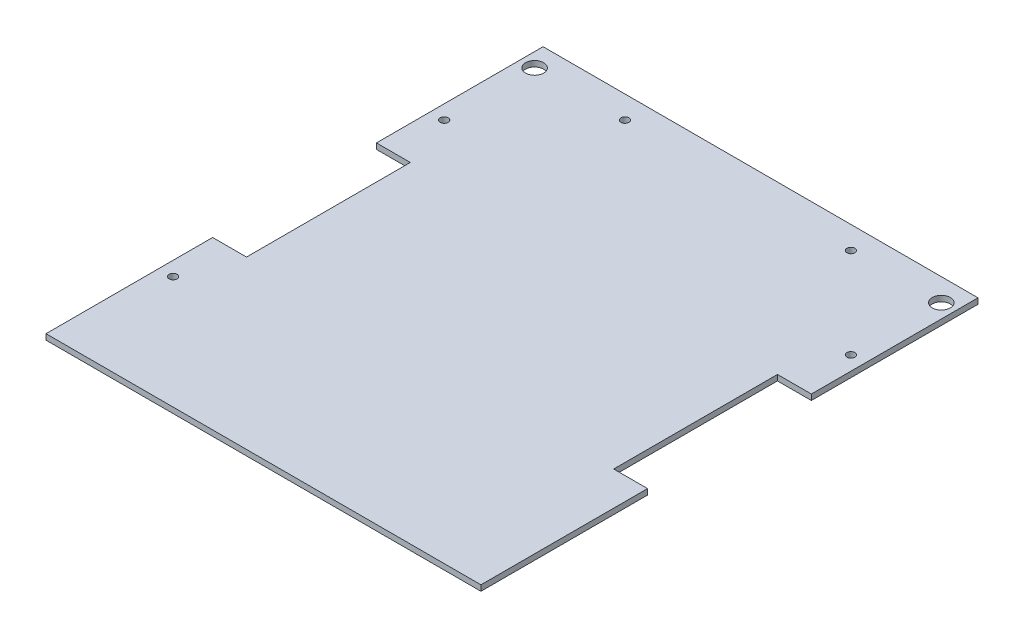
ISO-10303-21;
HEADER;
FILE_DESCRIPTION(('STEP AP214'),'2;1');
FILE_NAME('part.step','',(''),(''),'','','');
FILE_SCHEMA(('AUTOMOTIVE_DESIGN { 1 0 10303 214 1 1 1 1 }'));
ENDSEC;
DATA;
#1=APPLICATION_CONTEXT('core data for automotive mechanical design processes');
#2=APPLICATION_PROTOCOL_DEFINITION('international standard','automotive_design',2000,#1);
#3=PRODUCT_CONTEXT('',#1,'mechanical');
#4=PRODUCT('Part','Part','',(#3));
#5=PRODUCT_RELATED_PRODUCT_CATEGORY('part','',(#4));
#6=PRODUCT_DEFINITION_FORMATION('','',#4);
#7=PRODUCT_DEFINITION_CONTEXT('part definition',#1,'design');
#8=PRODUCT_DEFINITION('design','',#6,#7);
#9=PRODUCT_DEFINITION_SHAPE('','',#8);
#10=(LENGTH_UNIT() NAMED_UNIT(*) SI_UNIT(.MILLI.,.METRE.));
#11=(NAMED_UNIT(*) PLANE_ANGLE_UNIT() SI_UNIT($,.RADIAN.));
#12=(NAMED_UNIT(*) SI_UNIT($,.STERADIAN.) SOLID_ANGLE_UNIT());
#13=UNCERTAINTY_MEASURE_WITH_UNIT(LENGTH_MEASURE(1.E-05),#10,'distance_accuracy_value','');
#14=(GEOMETRIC_REPRESENTATION_CONTEXT(3) GLOBAL_UNCERTAINTY_ASSIGNED_CONTEXT((#13)) GLOBAL_UNIT_ASSIGNED_CONTEXT((#10,
#11,#12)) REPRESENTATION_CONTEXT('',''));
#15=CARTESIAN_POINT('',(0.,0.,0.));
#16=DIRECTION('',(0.,0.,1.));
#17=DIRECTION('',(1.,0.,0.));
#18=AXIS2_PLACEMENT_3D('',#15,#16,#17);
#19=CARTESIAN_POINT('',(228.6,3.175,139.7));
#20=DIRECTION('',(0.,0.,-1.));
#21=DIRECTION('',(-1.,0.,0.));
#22=AXIS2_PLACEMENT_3D('',#19,#20,#21);
#23=PLANE('',#22);
#24=DIRECTION('',(0.,1.,0.));
#25=VECTOR('',#24,1.);
#26=CARTESIAN_POINT('',(122.2375,-22.225,139.7));
#27=LINE('',#26,#25);
#28=CARTESIAN_POINT('',(122.2375,0.,139.7));
#29=VERTEX_POINT('',#28);
#30=CARTESIAN_POINT('',(122.2375,3.175,139.7));
#31=VERTEX_POINT('',#30);
#32=EDGE_CURVE('E231',#29,#31,#27,.T.);
#33=ORIENTED_EDGE('',*,*,#32,.T.);
#34=DIRECTION('',(1.,0.,0.));
#35=VECTOR('',#34,1.);
#36=CARTESIAN_POINT('',(228.6,3.175,139.7));
#37=LINE('',#36,#35);
#38=CARTESIAN_POINT('',(-122.2375,3.175,139.7));
#39=VERTEX_POINT('',#38);
#40=EDGE_CURVE('E181',#39,#31,#37,.T.);
#41=ORIENTED_EDGE('',*,*,#40,.F.);
#42=DIRECTION('',(0.,1.,0.));
#43=VECTOR('',#42,1.);
#44=CARTESIAN_POINT('',(-122.2375,-22.225,139.7));
#45=LINE('',#44,#43);
#46=CARTESIAN_POINT('',(-122.2375,0.,139.7));
#47=VERTEX_POINT('',#46);
#48=EDGE_CURVE('E150',#47,#39,#45,.T.);
#49=ORIENTED_EDGE('',*,*,#48,.F.);
#50=DIRECTION('',(1.,0.,0.));
#51=VECTOR('',#50,1.);
#52=CARTESIAN_POINT('',(228.6,0.,139.7));
#53=LINE('',#52,#51);
#54=EDGE_CURVE('E184',#47,#29,#53,.T.);
#55=ORIENTED_EDGE('',*,*,#54,.T.);
#56=EDGE_LOOP('',(#33,#41,#49,#55));
#57=FACE_BOUND('',#56,.T.);
#58=ADVANCED_FACE('F44',(#57),#23,.F.);
#59=CARTESIAN_POINT('',(228.6,3.175,-139.7));
#60=DIRECTION('',(0.,0.,1.));
#61=DIRECTION('',(1.,0.,0.));
#62=AXIS2_PLACEMENT_3D('',#59,#60,#61);
#63=PLANE('',#62);
#64=DIRECTION('',(0.,1.,0.));
#65=VECTOR('',#64,1.);
#66=CARTESIAN_POINT('',(122.2375,-22.225,-139.7));
#67=LINE('',#66,#65);
#68=CARTESIAN_POINT('',(122.2375,0.,-139.7));
#69=VERTEX_POINT('',#68);
#70=CARTESIAN_POINT('',(122.2375,3.175,-139.7));
#71=VERTEX_POINT('',#70);
#72=EDGE_CURVE('E145',#69,#71,#67,.T.);
#73=ORIENTED_EDGE('',*,*,#72,.F.);
#74=DIRECTION('',(-1.,0.,0.));
#75=VECTOR('',#74,1.);
#76=CARTESIAN_POINT('',(228.6,0.,-139.7));
#77=LINE('',#76,#75);
#78=CARTESIAN_POINT('',(-122.2375,0.,-139.7));
#79=VERTEX_POINT('',#78);
#80=EDGE_CURVE('E187',#69,#79,#77,.T.);
#81=ORIENTED_EDGE('',*,*,#80,.T.);
#82=DIRECTION('',(0.,1.,0.));
#83=VECTOR('',#82,1.);
#84=CARTESIAN_POINT('',(-122.2375,-22.225,-139.7));
#85=LINE('',#84,#83);
#86=CARTESIAN_POINT('',(-122.2375,3.175,-139.7));
#87=VERTEX_POINT('',#86);
#88=EDGE_CURVE('E291',#79,#87,#85,.T.);
#89=ORIENTED_EDGE('',*,*,#88,.T.);
#90=DIRECTION('',(-1.,0.,0.));
#91=VECTOR('',#90,1.);
#92=CARTESIAN_POINT('',(228.6,3.175,-139.7));
#93=LINE('',#92,#91);
#94=EDGE_CURVE('E175',#71,#87,#93,.T.);
#95=ORIENTED_EDGE('',*,*,#94,.F.);
#96=EDGE_LOOP('',(#73,#81,#89,#95));
#97=FACE_BOUND('',#96,.T.);
#98=ADVANCED_FACE('F354',(#97),#63,.F.);
#99=CARTESIAN_POINT('',(0.,3.175,0.));
#100=DIRECTION('',(0.,1.,0.));
#101=DIRECTION('',(0.,0.,1.));
#102=AXIS2_PLACEMENT_3D('',#99,#100,#101);
#103=PLANE('',#102);
#104=CARTESIAN_POINT('',(114.3,3.175,-127.));
#105=DIRECTION('',(0.,1.,0.));
#106=DIRECTION('',(0.,0.,-1.));
#107=AXIS2_PLACEMENT_3D('',#104,#105,#106);
#108=CIRCLE('',#107,5.08);
#109=CARTESIAN_POINT('',(114.3,3.175,-132.08));
#110=VERTEX_POINT('',#109);
#111=EDGE_CURVE('E207',#110,#110,#108,.T.);
#112=ORIENTED_EDGE('',*,*,#111,.F.);
#113=EDGE_LOOP('',(#112));
#114=FACE_BOUND('',#113,.T.);
#115=CARTESIAN_POINT('',(-114.3,3.175,-127.));
#116=DIRECTION('',(0.,1.,0.));
#117=DIRECTION('',(0.,0.,1.));
#118=AXIS2_PLACEMENT_3D('',#115,#116,#117);
#119=CIRCLE('',#118,5.08);
#120=CARTESIAN_POINT('',(-114.3,3.175,-121.92));
#121=VERTEX_POINT('',#120);
#122=EDGE_CURVE('E321',#121,#121,#119,.T.);
#123=ORIENTED_EDGE('',*,*,#122,.F.);
#124=EDGE_LOOP('',(#123));
#125=FACE_BOUND('',#124,.T.);
#126=CARTESIAN_POINT('',(-114.3,3.175,76.2));
#127=DIRECTION('',(0.,1.,0.));
#128=DIRECTION('',(0.,0.,1.));
#129=AXIS2_PLACEMENT_3D('',#126,#127,#128);
#130=CIRCLE('',#129,2.25);
#131=CARTESIAN_POINT('',(-114.3,3.175,78.45));
#132=VERTEX_POINT('',#131);
#133=EDGE_CURVE('E195',#132,#132,#130,.T.);
#134=ORIENTED_EDGE('',*,*,#133,.F.);
#135=EDGE_LOOP('',(#134));
#136=FACE_BOUND('',#135,.T.);
#137=CARTESIAN_POINT('',(63.4999999999999,3.175,-127.));
#138=DIRECTION('',(0.,1.,0.));
#139=DIRECTION('',(0.,0.,-1.));
#140=AXIS2_PLACEMENT_3D('',#137,#138,#139);
#141=CIRCLE('',#140,2.25);
#142=CARTESIAN_POINT('',(63.4999999999999,3.175,-129.25));
#143=VERTEX_POINT('',#142);
#144=EDGE_CURVE('E304',#143,#143,#141,.T.);
#145=ORIENTED_EDGE('',*,*,#144,.F.);
#146=EDGE_LOOP('',(#145));
#147=FACE_BOUND('',#146,.T.);
#148=CARTESIAN_POINT('',(-114.3,3.175,-76.2));
#149=DIRECTION('',(0.,1.,0.));
#150=DIRECTION('',(0.,0.,1.));
#151=AXIS2_PLACEMENT_3D('',#148,#149,#150);
#152=CIRCLE('',#151,2.25);
#153=CARTESIAN_POINT('',(-114.3,3.175,-73.95));
#154=VERTEX_POINT('',#153);
#155=EDGE_CURVE('E299',#154,#154,#152,.T.);
#156=ORIENTED_EDGE('',*,*,#155,.F.);
#157=EDGE_LOOP('',(#156));
#158=FACE_BOUND('',#157,.T.);
#159=CARTESIAN_POINT('',(-63.5,3.175,-127.));
#160=DIRECTION('',(0.,1.,0.));
#161=DIRECTION('',(0.,0.,1.));
#162=AXIS2_PLACEMENT_3D('',#159,#160,#161);
#163=CIRCLE('',#162,2.25);
#164=CARTESIAN_POINT('',(-63.5,3.175,-124.75));
#165=VERTEX_POINT('',#164);
#166=EDGE_CURVE('E305',#165,#165,#163,.T.);
#167=ORIENTED_EDGE('',*,*,#166,.F.);
#168=EDGE_LOOP('',(#167));
#169=FACE_BOUND('',#168,.T.);
#170=CARTESIAN_POINT('',(114.3,3.175,-76.2));
#171=DIRECTION('',(0.,1.,0.));
#172=DIRECTION('',(0.,0.,-1.));
#173=AXIS2_PLACEMENT_3D('',#170,#171,#172);
#174=CIRCLE('',#173,2.25);
#175=CARTESIAN_POINT('',(114.3,3.175,-78.45));
#176=VERTEX_POINT('',#175);
#177=EDGE_CURVE('E265',#176,#176,#174,.T.);
#178=ORIENTED_EDGE('',*,*,#177,.F.);
#179=EDGE_LOOP('',(#178));
#180=FACE_BOUND('',#179,.T.);
#181=DIRECTION('',(-1.,0.,0.));
#182=VECTOR('',#181,1.);
#183=CARTESIAN_POINT('',(0.,3.175,-46.0375));
#184=LINE('',#183,#182);
#185=CARTESIAN_POINT('',(122.2375,3.175,-46.0375000000001));
#186=VERTEX_POINT('',#185);
#187=CARTESIAN_POINT('',(103.1875,3.175,-46.0375000000001));
#188=VERTEX_POINT('',#187);
#189=EDGE_CURVE('E133',#186,#188,#184,.T.);
#190=ORIENTED_EDGE('',*,*,#189,.F.);
#191=DIRECTION('',(0.,0.,-1.));
#192=VECTOR('',#191,1.);
#193=CARTESIAN_POINT('',(122.2375,3.175,-1.06858966120171E-13));
#194=LINE('',#193,#192);
#195=EDGE_CURVE('E142',#186,#71,#194,.T.);
#196=ORIENTED_EDGE('',*,*,#195,.T.);
#197=ORIENTED_EDGE('',*,*,#94,.T.);
#198=DIRECTION('',(0.,0.,1.));
#199=VECTOR('',#198,1.);
#200=CARTESIAN_POINT('',(-122.2375,3.175,0.));
#201=LINE('',#200,#199);
#202=CARTESIAN_POINT('',(-122.2375,3.175,-46.0375));
#203=VERTEX_POINT('',#202);
#204=EDGE_CURVE('E282',#87,#203,#201,.T.);
#205=ORIENTED_EDGE('',*,*,#204,.T.);
#206=DIRECTION('',(1.,0.,0.));
#207=VECTOR('',#206,1.);
#208=CARTESIAN_POINT('',(0.,3.175,-46.0375));
#209=LINE('',#208,#207);
#210=CARTESIAN_POINT('',(-103.1875,3.175,-46.0375));
#211=VERTEX_POINT('',#210);
#212=EDGE_CURVE('E279',#203,#211,#209,.T.);
#213=ORIENTED_EDGE('',*,*,#212,.T.);
#214=DIRECTION('',(0.,0.,1.));
#215=VECTOR('',#214,1.);
#216=CARTESIAN_POINT('',(-103.1875,3.175,0.));
#217=LINE('',#216,#215);
#218=CARTESIAN_POINT('',(-103.1875,3.175,46.0375));
#219=VERTEX_POINT('',#218);
#220=EDGE_CURVE('E276',#211,#219,#217,.T.);
#221=ORIENTED_EDGE('',*,*,#220,.T.);
#222=DIRECTION('',(-1.,0.,0.));
#223=VECTOR('',#222,1.);
#224=CARTESIAN_POINT('',(0.,3.175,46.0374999999999));
#225=LINE('',#224,#223);
#226=CARTESIAN_POINT('',(-122.2375,3.175,46.0375));
#227=VERTEX_POINT('',#226);
#228=EDGE_CURVE('E252',#219,#227,#225,.T.);
#229=ORIENTED_EDGE('',*,*,#228,.T.);
#230=DIRECTION('',(0.,0.,-1.));
#231=VECTOR('',#230,1.);
#232=CARTESIAN_POINT('',(-122.2375,3.175,0.));
#233=LINE('',#232,#231);
#234=EDGE_CURVE('E247',#39,#227,#233,.T.);
#235=ORIENTED_EDGE('',*,*,#234,.F.);
#236=ORIENTED_EDGE('',*,*,#40,.T.);
#237=DIRECTION('',(0.,0.,-1.));
#238=VECTOR('',#237,1.);
#239=CARTESIAN_POINT('',(122.2375,3.175,-1.09598939610432E-13));
#240=LINE('',#239,#238);
#241=CARTESIAN_POINT('',(122.2375,3.175,46.0374999999999));
#242=VERTEX_POINT('',#241);
#243=EDGE_CURVE('E139',#31,#242,#240,.T.);
#244=ORIENTED_EDGE('',*,*,#243,.T.);
#245=DIRECTION('',(1.,0.,0.));
#246=VECTOR('',#245,1.);
#247=CARTESIAN_POINT('',(0.,3.175,46.0374999999999));
#248=LINE('',#247,#246);
#249=CARTESIAN_POINT('',(103.1875,3.175,46.0374999999999));
#250=VERTEX_POINT('',#249);
#251=EDGE_CURVE('E160',#250,#242,#248,.T.);
#252=ORIENTED_EDGE('',*,*,#251,.F.);
#253=DIRECTION('',(0.,0.,1.));
#254=VECTOR('',#253,1.);
#255=CARTESIAN_POINT('',(103.1875,3.175,0.));
#256=LINE('',#255,#254);
#257=EDGE_CURVE('E155',#188,#250,#256,.T.);
#258=ORIENTED_EDGE('',*,*,#257,.F.);
#259=EDGE_LOOP('',(#190,#196,#197,#205,#213,#221,#229,#235,#236,#244,#252,#258));
#260=FACE_BOUND('',#259,.T.);
#261=ADVANCED_FACE('F152',(#114,#125,#136,#147,#158,#169,#180,#260),#103,.T.);
#262=CARTESIAN_POINT('',(0.,0.,0.));
#263=DIRECTION('',(0.,1.,0.));
#264=DIRECTION('',(0.,0.,1.));
#265=AXIS2_PLACEMENT_3D('',#262,#263,#264);
#266=PLANE('',#265);
#267=CARTESIAN_POINT('',(114.3,0.,-127.));
#268=DIRECTION('',(0.,1.,0.));
#269=DIRECTION('',(0.,0.,-1.));
#270=AXIS2_PLACEMENT_3D('',#267,#268,#269);
#271=CIRCLE('',#270,5.08);
#272=CARTESIAN_POINT('',(114.3,0.,-132.08));
#273=VERTEX_POINT('',#272);
#274=EDGE_CURVE('E318',#273,#273,#271,.T.);
#275=ORIENTED_EDGE('',*,*,#274,.T.);
#276=EDGE_LOOP('',(#275));
#277=FACE_BOUND('',#276,.T.);
#278=CARTESIAN_POINT('',(-114.3,0.,-127.));
#279=DIRECTION('',(0.,1.,0.));
#280=DIRECTION('',(0.,0.,1.));
#281=AXIS2_PLACEMENT_3D('',#278,#279,#280);
#282=CIRCLE('',#281,5.08);
#283=CARTESIAN_POINT('',(-114.3,0.,-121.92));
#284=VERTEX_POINT('',#283);
#285=EDGE_CURVE('E188',#284,#284,#282,.T.);
#286=ORIENTED_EDGE('',*,*,#285,.T.);
#287=EDGE_LOOP('',(#286));
#288=FACE_BOUND('',#287,.T.);
#289=CARTESIAN_POINT('',(-114.3,0.,76.2));
#290=DIRECTION('',(0.,1.,0.));
#291=DIRECTION('',(0.,0.,1.));
#292=AXIS2_PLACEMENT_3D('',#289,#290,#291);
#293=CIRCLE('',#292,2.25);
#294=CARTESIAN_POINT('',(-114.3,0.,78.45));
#295=VERTEX_POINT('',#294);
#296=EDGE_CURVE('E191',#295,#295,#293,.T.);
#297=ORIENTED_EDGE('',*,*,#296,.T.);
#298=EDGE_LOOP('',(#297));
#299=FACE_BOUND('',#298,.T.);
#300=CARTESIAN_POINT('',(63.4999999999999,0.,-127.));
#301=DIRECTION('',(0.,1.,0.));
#302=DIRECTION('',(0.,0.,1.));
#303=AXIS2_PLACEMENT_3D('',#300,#301,#302);
#304=CIRCLE('',#303,2.25);
#305=CARTESIAN_POINT('',(63.4999999999999,0.,-124.75));
#306=VERTEX_POINT('',#305);
#307=EDGE_CURVE('E194',#306,#306,#304,.T.);
#308=ORIENTED_EDGE('',*,*,#307,.T.);
#309=EDGE_LOOP('',(#308));
#310=FACE_BOUND('',#309,.T.);
#311=CARTESIAN_POINT('',(-114.3,0.,-76.2));
#312=DIRECTION('',(0.,1.,0.));
#313=DIRECTION('',(0.,0.,1.));
#314=AXIS2_PLACEMENT_3D('',#311,#312,#313);
#315=CIRCLE('',#314,2.25);
#316=CARTESIAN_POINT('',(-114.3,0.,-73.95));
#317=VERTEX_POINT('',#316);
#318=EDGE_CURVE('E198',#317,#317,#315,.T.);
#319=ORIENTED_EDGE('',*,*,#318,.T.);
#320=EDGE_LOOP('',(#319));
#321=FACE_BOUND('',#320,.T.);
#322=CARTESIAN_POINT('',(-63.5,0.,-127.));
#323=DIRECTION('',(0.,1.,0.));
#324=DIRECTION('',(0.,0.,1.));
#325=AXIS2_PLACEMENT_3D('',#322,#323,#324);
#326=CIRCLE('',#325,2.25);
#327=CARTESIAN_POINT('',(-63.5,0.,-124.75));
#328=VERTEX_POINT('',#327);
#329=EDGE_CURVE('E201',#328,#328,#326,.T.);
#330=ORIENTED_EDGE('',*,*,#329,.T.);
#331=EDGE_LOOP('',(#330));
#332=FACE_BOUND('',#331,.T.);
#333=CARTESIAN_POINT('',(114.3,0.,-76.2));
#334=DIRECTION('',(0.,1.,0.));
#335=DIRECTION('',(0.,0.,1.));
#336=AXIS2_PLACEMENT_3D('',#333,#334,#335);
#337=CIRCLE('',#336,2.25);
#338=CARTESIAN_POINT('',(114.3,0.,-73.95));
#339=VERTEX_POINT('',#338);
#340=EDGE_CURVE('E204',#339,#339,#337,.T.);
#341=ORIENTED_EDGE('',*,*,#340,.T.);
#342=EDGE_LOOP('',(#341));
#343=FACE_BOUND('',#342,.T.);
#344=DIRECTION('',(0.,0.,-1.));
#345=VECTOR('',#344,1.);
#346=CARTESIAN_POINT('',(122.2375,0.,-1.06858966120171E-13));
#347=LINE('',#346,#345);
#348=CARTESIAN_POINT('',(122.2375,0.,-46.0375000000001));
#349=VERTEX_POINT('',#348);
#350=EDGE_CURVE('E12',#349,#69,#347,.T.);
#351=ORIENTED_EDGE('',*,*,#350,.F.);
#352=DIRECTION('',(-1.,0.,0.));
#353=VECTOR('',#352,1.);
#354=CARTESIAN_POINT('',(0.,0.,-46.0375));
#355=LINE('',#354,#353);
#356=CARTESIAN_POINT('',(103.1875,0.,-46.0375000000001));
#357=VERTEX_POINT('',#356);
#358=EDGE_CURVE('E136',#349,#357,#355,.T.);
#359=ORIENTED_EDGE('',*,*,#358,.T.);
#360=DIRECTION('',(0.,0.,1.));
#361=VECTOR('',#360,1.);
#362=CARTESIAN_POINT('',(103.1875,0.,0.));
#363=LINE('',#362,#361);
#364=CARTESIAN_POINT('',(103.1875,0.,46.0374999999999));
#365=VERTEX_POINT('',#364);
#366=EDGE_CURVE('E219',#357,#365,#363,.T.);
#367=ORIENTED_EDGE('',*,*,#366,.T.);
#368=DIRECTION('',(1.,0.,0.));
#369=VECTOR('',#368,1.);
#370=CARTESIAN_POINT('',(0.,0.,46.0374999999999));
#371=LINE('',#370,#369);
#372=CARTESIAN_POINT('',(122.2375,0.,46.0374999999999));
#373=VERTEX_POINT('',#372);
#374=EDGE_CURVE('E222',#365,#373,#371,.T.);
#375=ORIENTED_EDGE('',*,*,#374,.T.);
#376=DIRECTION('',(0.,0.,-1.));
#377=VECTOR('',#376,1.);
#378=CARTESIAN_POINT('',(122.2375,0.,-1.09598939610432E-13));
#379=LINE('',#378,#377);
#380=EDGE_CURVE('E51',#29,#373,#379,.T.);
#381=ORIENTED_EDGE('',*,*,#380,.F.);
#382=ORIENTED_EDGE('',*,*,#54,.F.);
#383=DIRECTION('',(0.,0.,-1.));
#384=VECTOR('',#383,1.);
#385=CARTESIAN_POINT('',(-122.2375,0.,0.));
#386=LINE('',#385,#384);
#387=CARTESIAN_POINT('',(-122.2375,0.,46.0375));
#388=VERTEX_POINT('',#387);
#389=EDGE_CURVE('E215',#47,#388,#386,.T.);
#390=ORIENTED_EDGE('',*,*,#389,.T.);
#391=DIRECTION('',(-1.,0.,0.));
#392=VECTOR('',#391,1.);
#393=CARTESIAN_POINT('',(0.,0.,46.0374999999999));
#394=LINE('',#393,#392);
#395=CARTESIAN_POINT('',(-103.1875,0.,46.0375));
#396=VERTEX_POINT('',#395);
#397=EDGE_CURVE('E180',#396,#388,#394,.T.);
#398=ORIENTED_EDGE('',*,*,#397,.F.);
#399=DIRECTION('',(0.,0.,1.));
#400=VECTOR('',#399,1.);
#401=CARTESIAN_POINT('',(-103.1875,0.,0.));
#402=LINE('',#401,#400);
#403=CARTESIAN_POINT('',(-103.1875,0.,-46.0375));
#404=VERTEX_POINT('',#403);
#405=EDGE_CURVE('E209',#404,#396,#402,.T.);
#406=ORIENTED_EDGE('',*,*,#405,.F.);
#407=DIRECTION('',(1.,0.,0.));
#408=VECTOR('',#407,1.);
#409=CARTESIAN_POINT('',(0.,0.,-46.0375));
#410=LINE('',#409,#408);
#411=CARTESIAN_POINT('',(-122.2375,0.,-46.0375));
#412=VERTEX_POINT('',#411);
#413=EDGE_CURVE('E211',#412,#404,#410,.T.);
#414=ORIENTED_EDGE('',*,*,#413,.F.);
#415=DIRECTION('',(0.,0.,1.));
#416=VECTOR('',#415,1.);
#417=CARTESIAN_POINT('',(-122.2375,0.,0.));
#418=LINE('',#417,#416);
#419=EDGE_CURVE('E213',#79,#412,#418,.T.);
#420=ORIENTED_EDGE('',*,*,#419,.F.);
#421=ORIENTED_EDGE('',*,*,#80,.F.);
#422=EDGE_LOOP('',(#351,#359,#367,#375,#381,#382,#390,#398,#406,#414,#420,#421));
#423=FACE_BOUND('',#422,.T.);
#424=ADVANCED_FACE('F240',(#277,#288,#299,#310,#321,#332,#343,#423),#266,.F.);
#425=CARTESIAN_POINT('',(114.3,0.,-127.));
#426=DIRECTION('',(0.,1.,0.));
#427=DIRECTION('',(0.,0.,1.));
#428=AXIS2_PLACEMENT_3D('',#425,#426,#427);
#429=CYLINDRICAL_SURFACE('',#428,5.08);
#430=ORIENTED_EDGE('',*,*,#274,.F.);
#431=EDGE_LOOP('',(#430));
#432=FACE_BOUND('',#431,.T.);
#433=ORIENTED_EDGE('',*,*,#111,.T.);
#434=EDGE_LOOP('',(#433));
#435=FACE_BOUND('',#434,.T.);
#436=ADVANCED_FACE('F341',(#432,#435),#429,.F.);
#437=CARTESIAN_POINT('',(-114.3,0.,-127.));
#438=DIRECTION('',(0.,1.,0.));
#439=DIRECTION('',(0.,0.,1.));
#440=AXIS2_PLACEMENT_3D('',#437,#438,#439);
#441=CYLINDRICAL_SURFACE('',#440,5.08);
#442=ORIENTED_EDGE('',*,*,#285,.F.);
#443=EDGE_LOOP('',(#442));
#444=FACE_BOUND('',#443,.T.);
#445=ORIENTED_EDGE('',*,*,#122,.T.);
#446=EDGE_LOOP('',(#445));
#447=FACE_BOUND('',#446,.T.);
#448=ADVANCED_FACE('F338',(#444,#447),#441,.F.);
#449=CARTESIAN_POINT('',(-114.3,-633.857,76.2));
#450=DIRECTION('',(0.,1.,0.));
#451=DIRECTION('',(0.,0.,1.));
#452=AXIS2_PLACEMENT_3D('',#449,#450,#451);
#453=CYLINDRICAL_SURFACE('',#452,2.25);
#454=ORIENTED_EDGE('',*,*,#133,.T.);
#455=EDGE_LOOP('',(#454));
#456=FACE_BOUND('',#455,.T.);
#457=ORIENTED_EDGE('',*,*,#296,.F.);
#458=EDGE_LOOP('',(#457));
#459=FACE_BOUND('',#458,.T.);
#460=ADVANCED_FACE('F340',(#456,#459),#453,.F.);
#461=CARTESIAN_POINT('',(63.4999999999999,-633.857,-127.));
#462=DIRECTION('',(0.,1.,0.));
#463=DIRECTION('',(0.,0.,1.));
#464=AXIS2_PLACEMENT_3D('',#461,#462,#463);
#465=CYLINDRICAL_SURFACE('',#464,2.25);
#466=ORIENTED_EDGE('',*,*,#144,.T.);
#467=EDGE_LOOP('',(#466));
#468=FACE_BOUND('',#467,.T.);
#469=ORIENTED_EDGE('',*,*,#307,.F.);
#470=EDGE_LOOP('',(#469));
#471=FACE_BOUND('',#470,.T.);
#472=ADVANCED_FACE('F347',(#468,#471),#465,.F.);
#473=CARTESIAN_POINT('',(-114.3,-633.857,-76.2));
#474=DIRECTION('',(0.,1.,0.));
#475=DIRECTION('',(0.,0.,1.));
#476=AXIS2_PLACEMENT_3D('',#473,#474,#475);
#477=CYLINDRICAL_SURFACE('',#476,2.25);
#478=ORIENTED_EDGE('',*,*,#155,.T.);
#479=EDGE_LOOP('',(#478));
#480=FACE_BOUND('',#479,.T.);
#481=ORIENTED_EDGE('',*,*,#318,.F.);
#482=EDGE_LOOP('',(#481));
#483=FACE_BOUND('',#482,.T.);
#484=ADVANCED_FACE('F395',(#480,#483),#477,.F.);
#485=CARTESIAN_POINT('',(-63.5,-633.857,-127.));
#486=DIRECTION('',(0.,1.,0.));
#487=DIRECTION('',(0.,0.,1.));
#488=AXIS2_PLACEMENT_3D('',#485,#486,#487);
#489=CYLINDRICAL_SURFACE('',#488,2.25);
#490=ORIENTED_EDGE('',*,*,#166,.T.);
#491=EDGE_LOOP('',(#490));
#492=FACE_BOUND('',#491,.T.);
#493=ORIENTED_EDGE('',*,*,#329,.F.);
#494=EDGE_LOOP('',(#493));
#495=FACE_BOUND('',#494,.T.);
#496=ADVANCED_FACE('F391',(#492,#495),#489,.F.);
#497=CARTESIAN_POINT('',(114.3,-633.857,-76.2));
#498=DIRECTION('',(0.,1.,0.));
#499=DIRECTION('',(0.,0.,1.));
#500=AXIS2_PLACEMENT_3D('',#497,#498,#499);
#501=CYLINDRICAL_SURFACE('',#500,2.25);
#502=ORIENTED_EDGE('',*,*,#177,.T.);
#503=EDGE_LOOP('',(#502));
#504=FACE_BOUND('',#503,.T.);
#505=ORIENTED_EDGE('',*,*,#340,.F.);
#506=EDGE_LOOP('',(#505));
#507=FACE_BOUND('',#506,.T.);
#508=ADVANCED_FACE('F394',(#504,#507),#501,.F.);
#509=CARTESIAN_POINT('',(-122.2375,-22.225,0.));
#510=DIRECTION('',(1.,0.,0.));
#511=DIRECTION('',(0.,0.,-1.));
#512=AXIS2_PLACEMENT_3D('',#509,#510,#511);
#513=PLANE('',#512);
#514=ORIENTED_EDGE('',*,*,#48,.T.);
#515=ORIENTED_EDGE('',*,*,#234,.T.);
#516=DIRECTION('',(0.,1.,0.));
#517=VECTOR('',#516,1.);
#518=CARTESIAN_POINT('',(-122.2375,-22.225,46.0375));
#519=LINE('',#518,#517);
#520=EDGE_CURVE('E285',#388,#227,#519,.T.);
#521=ORIENTED_EDGE('',*,*,#520,.F.);
#522=ORIENTED_EDGE('',*,*,#389,.F.);
#523=EDGE_LOOP('',(#514,#515,#521,#522));
#524=FACE_BOUND('',#523,.T.);
#525=ADVANCED_FACE('F402',(#524),#513,.F.);
#526=CARTESIAN_POINT('',(-122.2375,-22.225,0.));
#527=DIRECTION('',(-1.,0.,0.));
#528=DIRECTION('',(0.,0.,1.));
#529=AXIS2_PLACEMENT_3D('',#526,#527,#528);
#530=PLANE('',#529);
#531=ORIENTED_EDGE('',*,*,#419,.T.);
#532=DIRECTION('',(0.,1.,0.));
#533=VECTOR('',#532,1.);
#534=CARTESIAN_POINT('',(-122.2375,-22.225,-46.0375));
#535=LINE('',#534,#533);
#536=EDGE_CURVE('E294',#412,#203,#535,.T.);
#537=ORIENTED_EDGE('',*,*,#536,.T.);
#538=ORIENTED_EDGE('',*,*,#204,.F.);
#539=ORIENTED_EDGE('',*,*,#88,.F.);
#540=EDGE_LOOP('',(#531,#537,#538,#539));
#541=FACE_BOUND('',#540,.T.);
#542=ADVANCED_FACE('F406',(#541),#530,.T.);
#543=CARTESIAN_POINT('',(0.,-22.225,-46.0375));
#544=DIRECTION('',(0.,0.,1.));
#545=DIRECTION('',(1.,0.,0.));
#546=AXIS2_PLACEMENT_3D('',#543,#544,#545);
#547=PLANE('',#546);
#548=ORIENTED_EDGE('',*,*,#413,.T.);
#549=DIRECTION('',(0.,1.,0.));
#550=VECTOR('',#549,1.);
#551=CARTESIAN_POINT('',(-103.1875,-22.225,-46.0375));
#552=LINE('',#551,#550);
#553=EDGE_CURVE('E296',#404,#211,#552,.T.);
#554=ORIENTED_EDGE('',*,*,#553,.T.);
#555=ORIENTED_EDGE('',*,*,#212,.F.);
#556=ORIENTED_EDGE('',*,*,#536,.F.);
#557=EDGE_LOOP('',(#548,#554,#555,#556));
#558=FACE_BOUND('',#557,.T.);
#559=ADVANCED_FACE('F432',(#558),#547,.T.);
#560=CARTESIAN_POINT('',(-103.1875,-22.225,0.));
#561=DIRECTION('',(-1.,0.,0.));
#562=DIRECTION('',(0.,0.,1.));
#563=AXIS2_PLACEMENT_3D('',#560,#561,#562);
#564=PLANE('',#563);
#565=ORIENTED_EDGE('',*,*,#405,.T.);
#566=DIRECTION('',(0.,1.,0.));
#567=VECTOR('',#566,1.);
#568=CARTESIAN_POINT('',(-103.1875,-22.225,46.0375));
#569=LINE('',#568,#567);
#570=EDGE_CURVE('E66',#396,#219,#569,.T.);
#571=ORIENTED_EDGE('',*,*,#570,.T.);
#572=ORIENTED_EDGE('',*,*,#220,.F.);
#573=ORIENTED_EDGE('',*,*,#553,.F.);
#574=EDGE_LOOP('',(#565,#571,#572,#573));
#575=FACE_BOUND('',#574,.T.);
#576=ADVANCED_FACE('F429',(#575),#564,.T.);
#577=CARTESIAN_POINT('',(0.,-22.225,46.0374999999999));
#578=DIRECTION('',(0.,0.,-1.));
#579=DIRECTION('',(-1.,0.,0.));
#580=AXIS2_PLACEMENT_3D('',#577,#578,#579);
#581=PLANE('',#580);
#582=ORIENTED_EDGE('',*,*,#397,.T.);
#583=ORIENTED_EDGE('',*,*,#520,.T.);
#584=ORIENTED_EDGE('',*,*,#228,.F.);
#585=ORIENTED_EDGE('',*,*,#570,.F.);
#586=EDGE_LOOP('',(#582,#583,#584,#585));
#587=FACE_BOUND('',#586,.T.);
#588=ADVANCED_FACE('F426',(#587),#581,.T.);
#589=CARTESIAN_POINT('',(122.2375,-22.225,-1.06858966120171E-13));
#590=DIRECTION('',(1.,0.,0.));
#591=DIRECTION('',(0.,0.,-1.));
#592=AXIS2_PLACEMENT_3D('',#589,#590,#591);
#593=PLANE('',#592);
#594=ORIENTED_EDGE('',*,*,#350,.T.);
#595=ORIENTED_EDGE('',*,*,#72,.T.);
#596=ORIENTED_EDGE('',*,*,#195,.F.);
#597=DIRECTION('',(0.,1.,0.));
#598=VECTOR('',#597,1.);
#599=CARTESIAN_POINT('',(122.2375,-22.225,-46.0375000000001));
#600=LINE('',#599,#598);
#601=EDGE_CURVE('E129',#349,#186,#600,.T.);
#602=ORIENTED_EDGE('',*,*,#601,.F.);
#603=EDGE_LOOP('',(#594,#595,#596,#602));
#604=FACE_BOUND('',#603,.T.);
#605=ADVANCED_FACE('F143',(#604),#593,.T.);
#606=CARTESIAN_POINT('',(122.2375,-22.225,-1.09598939610432E-13));
#607=DIRECTION('',(1.,0.,0.));
#608=DIRECTION('',(0.,0.,-1.));
#609=AXIS2_PLACEMENT_3D('',#606,#607,#608);
#610=PLANE('',#609);
#611=ORIENTED_EDGE('',*,*,#380,.T.);
#612=DIRECTION('',(0.,1.,0.));
#613=VECTOR('',#612,1.);
#614=CARTESIAN_POINT('',(122.2375,-22.225,46.0374999999999));
#615=LINE('',#614,#613);
#616=EDGE_CURVE('E228',#373,#242,#615,.T.);
#617=ORIENTED_EDGE('',*,*,#616,.T.);
#618=ORIENTED_EDGE('',*,*,#243,.F.);
#619=ORIENTED_EDGE('',*,*,#32,.F.);
#620=EDGE_LOOP('',(#611,#617,#618,#619));
#621=FACE_BOUND('',#620,.T.);
#622=ADVANCED_FACE('F227',(#621),#610,.T.);
#623=CARTESIAN_POINT('',(0.,-22.225,46.0374999999999));
#624=DIRECTION('',(0.,0.,1.));
#625=DIRECTION('',(1.,0.,0.));
#626=AXIS2_PLACEMENT_3D('',#623,#624,#625);
#627=PLANE('',#626);
#628=DIRECTION('',(0.,1.,0.));
#629=VECTOR('',#628,1.);
#630=CARTESIAN_POINT('',(103.1875,-22.225,46.0374999999999));
#631=LINE('',#630,#629);
#632=EDGE_CURVE('E238',#365,#250,#631,.T.);
#633=ORIENTED_EDGE('',*,*,#632,.T.);
#634=ORIENTED_EDGE('',*,*,#251,.T.);
#635=ORIENTED_EDGE('',*,*,#616,.F.);
#636=ORIENTED_EDGE('',*,*,#374,.F.);
#637=EDGE_LOOP('',(#633,#634,#635,#636));
#638=FACE_BOUND('',#637,.T.);
#639=ADVANCED_FACE('F235',(#638),#627,.F.);
#640=CARTESIAN_POINT('',(103.1875,-22.225,0.));
#641=DIRECTION('',(-1.,0.,0.));
#642=DIRECTION('',(0.,0.,1.));
#643=AXIS2_PLACEMENT_3D('',#640,#641,#642);
#644=PLANE('',#643);
#645=DIRECTION('',(0.,1.,0.));
#646=VECTOR('',#645,1.);
#647=CARTESIAN_POINT('',(103.1875,-22.225,-46.0375000000001));
#648=LINE('',#647,#646);
#649=EDGE_CURVE('E58',#357,#188,#648,.T.);
#650=ORIENTED_EDGE('',*,*,#649,.T.);
#651=ORIENTED_EDGE('',*,*,#257,.T.);
#652=ORIENTED_EDGE('',*,*,#632,.F.);
#653=ORIENTED_EDGE('',*,*,#366,.F.);
#654=EDGE_LOOP('',(#650,#651,#652,#653));
#655=FACE_BOUND('',#654,.T.);
#656=ADVANCED_FACE('F242',(#655),#644,.F.);
#657=CARTESIAN_POINT('',(0.,-22.225,-46.0375));
#658=DIRECTION('',(0.,0.,-1.));
#659=DIRECTION('',(-1.,0.,0.));
#660=AXIS2_PLACEMENT_3D('',#657,#658,#659);
#661=PLANE('',#660);
#662=ORIENTED_EDGE('',*,*,#601,.T.);
#663=ORIENTED_EDGE('',*,*,#189,.T.);
#664=ORIENTED_EDGE('',*,*,#649,.F.);
#665=ORIENTED_EDGE('',*,*,#358,.F.);
#666=EDGE_LOOP('',(#662,#663,#664,#665));
#667=FACE_BOUND('',#666,.T.);
#668=ADVANCED_FACE('F131',(#667),#661,.F.);
#669=CLOSED_SHELL('',(#58,#98,#261,#424,#436,#448,#460,#472,#484,#496,#508,#525,#542,#559,#576,
#588,#605,#622,#639,#656,#668));
#670=MANIFOLD_SOLID_BREP('B2',#669);
#671=ADVANCED_BREP_SHAPE_REPRESENTATION('',(#18,#670),#14);
#672=SHAPE_DEFINITION_REPRESENTATION(#9,#671);
ENDSEC;
END-ISO-10303-21;
